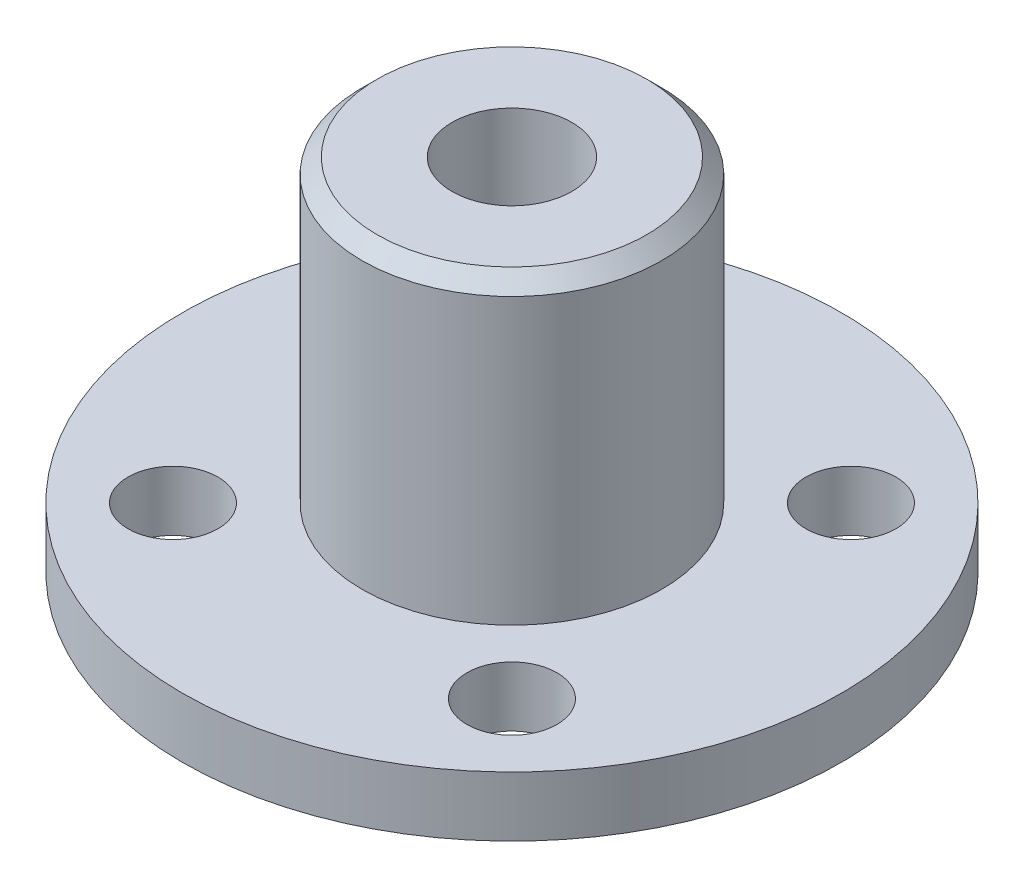
ISO-10303-21;
HEADER;
FILE_DESCRIPTION(('STEP AP214'),'2;1');
FILE_NAME('part.step','',(''),(''),'','','');
FILE_SCHEMA(('AUTOMOTIVE_DESIGN { 1 0 10303 214 1 1 1 1 }'));
ENDSEC;
DATA;
#1=APPLICATION_CONTEXT('core data for automotive mechanical design processes');
#2=APPLICATION_PROTOCOL_DEFINITION('international standard','automotive_design',2000,#1);
#3=PRODUCT_CONTEXT('',#1,'mechanical');
#4=PRODUCT('Part','Part','',(#3));
#5=PRODUCT_RELATED_PRODUCT_CATEGORY('part','',(#4));
#6=PRODUCT_DEFINITION_FORMATION('','',#4);
#7=PRODUCT_DEFINITION_CONTEXT('part definition',#1,'design');
#8=PRODUCT_DEFINITION('design','',#6,#7);
#9=PRODUCT_DEFINITION_SHAPE('','',#8);
#10=(LENGTH_UNIT() NAMED_UNIT(*) SI_UNIT(.MILLI.,.METRE.));
#11=(NAMED_UNIT(*) PLANE_ANGLE_UNIT() SI_UNIT($,.RADIAN.));
#12=(NAMED_UNIT(*) SI_UNIT($,.STERADIAN.) SOLID_ANGLE_UNIT());
#13=UNCERTAINTY_MEASURE_WITH_UNIT(LENGTH_MEASURE(1.E-05),#10,'distance_accuracy_value','');
#14=(GEOMETRIC_REPRESENTATION_CONTEXT(3) GLOBAL_UNCERTAINTY_ASSIGNED_CONTEXT((#13)) GLOBAL_UNIT_ASSIGNED_CONTEXT((#10,
#11,#12)) REPRESENTATION_CONTEXT('',''));
#15=CARTESIAN_POINT('',(0.,0.,0.));
#16=DIRECTION('',(0.,0.,1.));
#17=DIRECTION('',(1.,0.,0.));
#18=AXIS2_PLACEMENT_3D('',#15,#16,#17);
#19=CARTESIAN_POINT('',(0.,2.,0.));
#20=DIRECTION('',(0.,-1.,0.));
#21=DIRECTION('',(0.,0.,-1.));
#22=AXIS2_PLACEMENT_3D('',#19,#20,#21);
#23=CYLINDRICAL_SURFACE('',#22,11.);
#24=CARTESIAN_POINT('',(0.,2.,0.));
#25=DIRECTION('',(0.,1.,0.));
#26=DIRECTION('',(0.,0.,1.));
#27=AXIS2_PLACEMENT_3D('',#24,#25,#26);
#28=CIRCLE('',#27,11.);
#29=CARTESIAN_POINT('',(0.,2.,11.));
#30=VERTEX_POINT('',#29);
#31=EDGE_CURVE('E59',#30,#30,#28,.T.);
#32=ORIENTED_EDGE('',*,*,#31,.F.);
#33=EDGE_LOOP('',(#32));
#34=FACE_BOUND('',#33,.T.);
#35=CARTESIAN_POINT('',(0.,0.,0.));
#36=DIRECTION('',(0.,1.,0.));
#37=DIRECTION('',(0.,0.,1.));
#38=AXIS2_PLACEMENT_3D('',#35,#36,#37);
#39=CIRCLE('',#38,11.);
#40=CARTESIAN_POINT('',(0.,0.,11.));
#41=VERTEX_POINT('',#40);
#42=EDGE_CURVE('E62',#41,#41,#39,.T.);
#43=ORIENTED_EDGE('',*,*,#42,.T.);
#44=EDGE_LOOP('',(#43));
#45=FACE_BOUND('',#44,.T.);
#46=ADVANCED_FACE('F43',(#34,#45),#23,.T.);
#47=CARTESIAN_POINT('',(0.,2.,0.));
#48=DIRECTION('',(0.,1.,0.));
#49=DIRECTION('',(0.,0.,1.));
#50=AXIS2_PLACEMENT_3D('',#47,#48,#49);
#51=PLANE('',#50);
#52=CARTESIAN_POINT('',(-5.65685424949238,2.,5.65685424949238));
#53=DIRECTION('',(0.,1.,0.));
#54=DIRECTION('',(0.,0.,1.));
#55=AXIS2_PLACEMENT_3D('',#52,#53,#54);
#56=CIRCLE('',#55,1.5);
#57=CARTESIAN_POINT('',(-5.65685424949238,2.,7.15685424949238));
#58=VERTEX_POINT('',#57);
#59=EDGE_CURVE('E71',#58,#58,#56,.T.);
#60=ORIENTED_EDGE('',*,*,#59,.F.);
#61=EDGE_LOOP('',(#60));
#62=FACE_BOUND('',#61,.T.);
#63=CARTESIAN_POINT('',(5.65685424949238,2.,-5.65685424949238));
#64=DIRECTION('',(0.,1.,0.));
#65=DIRECTION('',(0.,0.,1.));
#66=AXIS2_PLACEMENT_3D('',#63,#64,#65);
#67=CIRCLE('',#66,1.5);
#68=CARTESIAN_POINT('',(5.65685424949238,2.,-4.15685424949238));
#69=VERTEX_POINT('',#68);
#70=EDGE_CURVE('E76',#69,#69,#67,.T.);
#71=ORIENTED_EDGE('',*,*,#70,.F.);
#72=EDGE_LOOP('',(#71));
#73=FACE_BOUND('',#72,.T.);
#74=CARTESIAN_POINT('',(-5.65685424949238,2.,-5.65685424949238));
#75=DIRECTION('',(0.,1.,0.));
#76=DIRECTION('',(0.,0.,1.));
#77=AXIS2_PLACEMENT_3D('',#74,#75,#76);
#78=CIRCLE('',#77,1.5);
#79=CARTESIAN_POINT('',(-5.65685424949238,2.,-4.15685424949238));
#80=VERTEX_POINT('',#79);
#81=EDGE_CURVE('E79',#80,#80,#78,.T.);
#82=ORIENTED_EDGE('',*,*,#81,.F.);
#83=EDGE_LOOP('',(#82));
#84=FACE_BOUND('',#83,.T.);
#85=CARTESIAN_POINT('',(5.65685424949238,2.,5.65685424949238));
#86=DIRECTION('',(0.,1.,0.));
#87=DIRECTION('',(0.,0.,1.));
#88=AXIS2_PLACEMENT_3D('',#85,#86,#87);
#89=CIRCLE('',#88,1.5);
#90=CARTESIAN_POINT('',(5.65685424949238,2.,7.15685424949238));
#91=VERTEX_POINT('',#90);
#92=EDGE_CURVE('E82',#91,#91,#89,.T.);
#93=ORIENTED_EDGE('',*,*,#92,.F.);
#94=EDGE_LOOP('',(#93));
#95=FACE_BOUND('',#94,.T.);
#96=CARTESIAN_POINT('',(0.,2.,0.));
#97=DIRECTION('',(0.,1.,0.));
#98=DIRECTION('',(0.,0.,1.));
#99=AXIS2_PLACEMENT_3D('',#96,#97,#98);
#100=CIRCLE('',#99,5.);
#101=CARTESIAN_POINT('',(0.,2.,5.));
#102=VERTEX_POINT('',#101);
#103=EDGE_CURVE('E55',#102,#102,#100,.T.);
#104=ORIENTED_EDGE('',*,*,#103,.F.);
#105=EDGE_LOOP('',(#104));
#106=FACE_BOUND('',#105,.T.);
#107=ORIENTED_EDGE('',*,*,#31,.T.);
#108=EDGE_LOOP('',(#107));
#109=FACE_BOUND('',#108,.T.);
#110=ADVANCED_FACE('F104',(#62,#73,#84,#95,#106,#109),#51,.T.);
#111=CARTESIAN_POINT('',(0.,0.,0.));
#112=DIRECTION('',(0.,1.,0.));
#113=DIRECTION('',(0.,0.,1.));
#114=AXIS2_PLACEMENT_3D('',#111,#112,#113);
#115=PLANE('',#114);
#116=CARTESIAN_POINT('',(-5.65685424949238,0.,5.65685424949238));
#117=DIRECTION('',(0.,-1.,0.));
#118=DIRECTION('',(0.,0.,-1.));
#119=AXIS2_PLACEMENT_3D('',#116,#117,#118);
#120=CIRCLE('',#119,1.5);
#121=CARTESIAN_POINT('',(-5.65685424949238,0.,4.15685424949238));
#122=VERTEX_POINT('',#121);
#123=EDGE_CURVE('E88',#122,#122,#120,.T.);
#124=ORIENTED_EDGE('',*,*,#123,.F.);
#125=EDGE_LOOP('',(#124));
#126=FACE_BOUND('',#125,.T.);
#127=CARTESIAN_POINT('',(5.65685424949238,0.,-5.65685424949238));
#128=DIRECTION('',(0.,-1.,0.));
#129=DIRECTION('',(0.,0.,-1.));
#130=AXIS2_PLACEMENT_3D('',#127,#128,#129);
#131=CIRCLE('',#130,1.5);
#132=CARTESIAN_POINT('',(5.65685424949238,0.,-7.15685424949238));
#133=VERTEX_POINT('',#132);
#134=EDGE_CURVE('E89',#133,#133,#131,.T.);
#135=ORIENTED_EDGE('',*,*,#134,.F.);
#136=EDGE_LOOP('',(#135));
#137=FACE_BOUND('',#136,.T.);
#138=CARTESIAN_POINT('',(-5.65685424949238,0.,-5.65685424949238));
#139=DIRECTION('',(0.,-1.,0.));
#140=DIRECTION('',(0.,0.,-1.));
#141=AXIS2_PLACEMENT_3D('',#138,#139,#140);
#142=CIRCLE('',#141,1.5);
#143=CARTESIAN_POINT('',(-5.65685424949238,0.,-7.15685424949238));
#144=VERTEX_POINT('',#143);
#145=EDGE_CURVE('E92',#144,#144,#142,.T.);
#146=ORIENTED_EDGE('',*,*,#145,.F.);
#147=EDGE_LOOP('',(#146));
#148=FACE_BOUND('',#147,.T.);
#149=CARTESIAN_POINT('',(5.65685424949238,0.,5.65685424949238));
#150=DIRECTION('',(0.,-1.,0.));
#151=DIRECTION('',(0.,0.,-1.));
#152=AXIS2_PLACEMENT_3D('',#149,#150,#151);
#153=CIRCLE('',#152,1.5);
#154=CARTESIAN_POINT('',(5.65685424949238,0.,4.15685424949238));
#155=VERTEX_POINT('',#154);
#156=EDGE_CURVE('E85',#155,#155,#153,.T.);
#157=ORIENTED_EDGE('',*,*,#156,.F.);
#158=EDGE_LOOP('',(#157));
#159=FACE_BOUND('',#158,.T.);
#160=CARTESIAN_POINT('',(0.,0.,0.));
#161=DIRECTION('',(0.,1.,0.));
#162=DIRECTION('',(0.,0.,1.));
#163=AXIS2_PLACEMENT_3D('',#160,#161,#162);
#164=CIRCLE('',#163,2.);
#165=CARTESIAN_POINT('',(0.,0.,2.));
#166=VERTEX_POINT('',#165);
#167=EDGE_CURVE('E65',#166,#166,#164,.T.);
#168=ORIENTED_EDGE('',*,*,#167,.T.);
#169=EDGE_LOOP('',(#168));
#170=FACE_BOUND('',#169,.T.);
#171=ORIENTED_EDGE('',*,*,#42,.F.);
#172=EDGE_LOOP('',(#171));
#173=FACE_BOUND('',#172,.T.);
#174=ADVANCED_FACE('F100',(#126,#137,#148,#159,#170,#173),#115,.F.);
#175=CARTESIAN_POINT('',(0.,12.,0.));
#176=DIRECTION('',(0.,-1.,0.));
#177=DIRECTION('',(0.,0.,-1.));
#178=AXIS2_PLACEMENT_3D('',#175,#176,#177);
#179=CYLINDRICAL_SURFACE('',#178,5.);
#180=CARTESIAN_POINT('',(0.,11.5,0.));
#181=DIRECTION('',(0.,1.,0.));
#182=DIRECTION('',(0.,0.,1.));
#183=AXIS2_PLACEMENT_3D('',#180,#181,#182);
#184=CIRCLE('',#183,5.);
#185=CARTESIAN_POINT('',(0.,11.5,5.));
#186=VERTEX_POINT('',#185);
#187=EDGE_CURVE('E10',#186,#186,#184,.F.);
#188=ORIENTED_EDGE('',*,*,#187,.T.);
#189=EDGE_LOOP('',(#188));
#190=FACE_BOUND('',#189,.T.);
#191=ORIENTED_EDGE('',*,*,#103,.T.);
#192=EDGE_LOOP('',(#191));
#193=FACE_BOUND('',#192,.T.);
#194=ADVANCED_FACE('F103',(#190,#193),#179,.T.);
#195=CARTESIAN_POINT('',(0.,12.,0.));
#196=DIRECTION('',(0.,1.,0.));
#197=DIRECTION('',(0.,0.,1.));
#198=AXIS2_PLACEMENT_3D('',#195,#196,#197);
#199=PLANE('',#198);
#200=CARTESIAN_POINT('',(0.,12.,0.));
#201=DIRECTION('',(0.,1.,0.));
#202=DIRECTION('',(0.,0.,1.));
#203=AXIS2_PLACEMENT_3D('',#200,#201,#202);
#204=CIRCLE('',#203,4.5);
#205=CARTESIAN_POINT('',(0.,12.,4.5));
#206=VERTEX_POINT('',#205);
#207=EDGE_CURVE('E51',#206,#206,#204,.T.);
#208=ORIENTED_EDGE('',*,*,#207,.T.);
#209=EDGE_LOOP('',(#208));
#210=FACE_BOUND('',#209,.T.);
#211=CARTESIAN_POINT('',(0.,12.,0.));
#212=DIRECTION('',(0.,1.,0.));
#213=DIRECTION('',(0.,0.,1.));
#214=AXIS2_PLACEMENT_3D('',#211,#212,#213);
#215=CIRCLE('',#214,2.);
#216=CARTESIAN_POINT('',(0.,12.,2.));
#217=VERTEX_POINT('',#216);
#218=EDGE_CURVE('E68',#217,#217,#215,.T.);
#219=ORIENTED_EDGE('',*,*,#218,.F.);
#220=EDGE_LOOP('',(#219));
#221=FACE_BOUND('',#220,.T.);
#222=ADVANCED_FACE('F125',(#210,#221),#199,.T.);
#223=CARTESIAN_POINT('',(0.,0.,0.));
#224=DIRECTION('',(0.,1.,0.));
#225=DIRECTION('',(0.,0.,1.));
#226=AXIS2_PLACEMENT_3D('',#223,#224,#225);
#227=CYLINDRICAL_SURFACE('',#226,2.);
#228=ORIENTED_EDGE('',*,*,#167,.F.);
#229=EDGE_LOOP('',(#228));
#230=FACE_BOUND('',#229,.T.);
#231=ORIENTED_EDGE('',*,*,#218,.T.);
#232=EDGE_LOOP('',(#231));
#233=FACE_BOUND('',#232,.T.);
#234=ADVANCED_FACE('F128',(#230,#233),#227,.F.);
#235=CARTESIAN_POINT('',(0.,12.,0.));
#236=DIRECTION('',(0.,-1.,0.));
#237=DIRECTION('',(0.,0.,-1.));
#238=AXIS2_PLACEMENT_3D('',#235,#236,#237);
#239=CONICAL_SURFACE('',#238,4.5,0.785398163397444);
#240=ORIENTED_EDGE('',*,*,#187,.F.);
#241=EDGE_LOOP('',(#240));
#242=FACE_BOUND('',#241,.T.);
#243=ORIENTED_EDGE('',*,*,#207,.F.);
#244=EDGE_LOOP('',(#243));
#245=FACE_BOUND('',#244,.T.);
#246=ADVANCED_FACE('F46',(#242,#245),#239,.T.);
#247=CARTESIAN_POINT('',(5.65685424949238,10.,5.65685424949238));
#248=DIRECTION('',(0.,-1.,0.));
#249=DIRECTION('',(0.,0.,-1.));
#250=AXIS2_PLACEMENT_3D('',#247,#248,#249);
#251=CYLINDRICAL_SURFACE('',#250,1.5);
#252=ORIENTED_EDGE('',*,*,#92,.T.);
#253=EDGE_LOOP('',(#252));
#254=FACE_BOUND('',#253,.T.);
#255=ORIENTED_EDGE('',*,*,#156,.T.);
#256=EDGE_LOOP('',(#255));
#257=FACE_BOUND('',#256,.T.);
#258=ADVANCED_FACE('F132',(#254,#257),#251,.F.);
#259=CARTESIAN_POINT('',(-5.65685424949238,10.,-5.65685424949238));
#260=DIRECTION('',(0.,-1.,0.));
#261=DIRECTION('',(0.,0.,-1.));
#262=AXIS2_PLACEMENT_3D('',#259,#260,#261);
#263=CYLINDRICAL_SURFACE('',#262,1.5);
#264=ORIENTED_EDGE('',*,*,#81,.T.);
#265=EDGE_LOOP('',(#264));
#266=FACE_BOUND('',#265,.T.);
#267=ORIENTED_EDGE('',*,*,#145,.T.);
#268=EDGE_LOOP('',(#267));
#269=FACE_BOUND('',#268,.T.);
#270=ADVANCED_FACE('F98',(#266,#269),#263,.F.);
#271=CARTESIAN_POINT('',(5.65685424949238,10.,-5.65685424949238));
#272=DIRECTION('',(0.,-1.,0.));
#273=DIRECTION('',(0.,0.,-1.));
#274=AXIS2_PLACEMENT_3D('',#271,#272,#273);
#275=CYLINDRICAL_SURFACE('',#274,1.5);
#276=ORIENTED_EDGE('',*,*,#70,.T.);
#277=EDGE_LOOP('',(#276));
#278=FACE_BOUND('',#277,.T.);
#279=ORIENTED_EDGE('',*,*,#134,.T.);
#280=EDGE_LOOP('',(#279));
#281=FACE_BOUND('',#280,.T.);
#282=ADVANCED_FACE('F136',(#278,#281),#275,.F.);
#283=CARTESIAN_POINT('',(-5.65685424949238,10.,5.65685424949238));
#284=DIRECTION('',(0.,-1.,0.));
#285=DIRECTION('',(0.,0.,-1.));
#286=AXIS2_PLACEMENT_3D('',#283,#284,#285);
#287=CYLINDRICAL_SURFACE('',#286,1.5);
#288=ORIENTED_EDGE('',*,*,#59,.T.);
#289=EDGE_LOOP('',(#288));
#290=FACE_BOUND('',#289,.T.);
#291=ORIENTED_EDGE('',*,*,#123,.T.);
#292=EDGE_LOOP('',(#291));
#293=FACE_BOUND('',#292,.T.);
#294=ADVANCED_FACE('F139',(#290,#293),#287,.F.);
#295=CLOSED_SHELL('',(#46,#110,#174,#194,#222,#234,#246,#258,#270,#282,#294));
#296=MANIFOLD_SOLID_BREP('B2',#295);
#297=ADVANCED_BREP_SHAPE_REPRESENTATION('',(#18,#296),#14);
#298=SHAPE_DEFINITION_REPRESENTATION(#9,#297);
ENDSEC;
END-ISO-10303-21;
